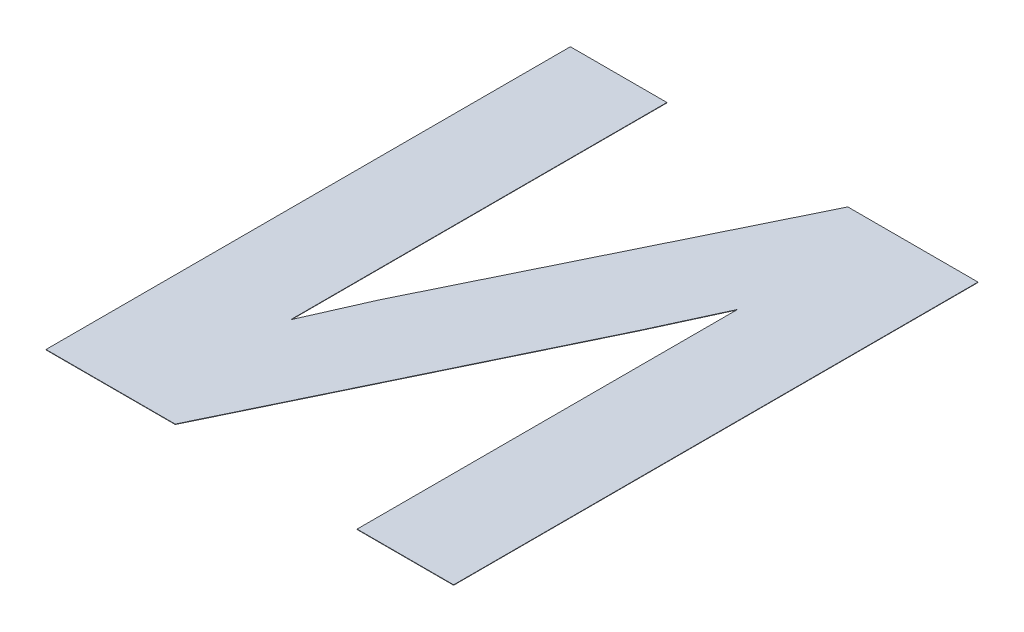
ISO-10303-21;
HEADER;
FILE_DESCRIPTION(('STEP AP214'),'2;1');
FILE_NAME('part.step','',(''),(''),'','','');
FILE_SCHEMA(('AUTOMOTIVE_DESIGN { 1 0 10303 214 1 1 1 1 }'));
ENDSEC;
DATA;
#1=APPLICATION_CONTEXT('core data for automotive mechanical design processes');
#2=APPLICATION_PROTOCOL_DEFINITION('international standard','automotive_design',2000,#1);
#3=PRODUCT_CONTEXT('',#1,'mechanical');
#4=PRODUCT('Part','Part','',(#3));
#5=PRODUCT_RELATED_PRODUCT_CATEGORY('part','',(#4));
#6=PRODUCT_DEFINITION_FORMATION('','',#4);
#7=PRODUCT_DEFINITION_CONTEXT('part definition',#1,'design');
#8=PRODUCT_DEFINITION('design','',#6,#7);
#9=PRODUCT_DEFINITION_SHAPE('','',#8);
#10=(LENGTH_UNIT() NAMED_UNIT(*) SI_UNIT(.MILLI.,.METRE.));
#11=(NAMED_UNIT(*) PLANE_ANGLE_UNIT() SI_UNIT($,.RADIAN.));
#12=(NAMED_UNIT(*) SI_UNIT($,.STERADIAN.) SOLID_ANGLE_UNIT());
#13=UNCERTAINTY_MEASURE_WITH_UNIT(LENGTH_MEASURE(1.E-05),#10,'distance_accuracy_value','');
#14=(GEOMETRIC_REPRESENTATION_CONTEXT(3) GLOBAL_UNCERTAINTY_ASSIGNED_CONTEXT((#13)) GLOBAL_UNIT_ASSIGNED_CONTEXT((#10,
#11,#12)) REPRESENTATION_CONTEXT('',''));
#15=CARTESIAN_POINT('',(0.,0.,0.));
#16=DIRECTION('',(0.,0.,1.));
#17=DIRECTION('',(1.,0.,0.));
#18=AXIS2_PLACEMENT_3D('',#15,#16,#17);
#19=CARTESIAN_POINT('',(26.67,0.00149999999999997,0.));
#20=DIRECTION('',(0.,-1.,0.));
#21=DIRECTION('',(0.,0.,-1.));
#22=AXIS2_PLACEMENT_3D('',#19,#20,#21);
#23=PLANE('',#22);
#24=DIRECTION('',(-0.418143605528176,0.,0.908380936147329));
#25=VECTOR('',#24,1.);
#26=CARTESIAN_POINT('',(10.316846398117,0.00149999999999997,-83.4365985771358));
#27=LINE('',#26,#25);
#28=CARTESIAN_POINT('',(10.316846398117,0.00149999999999997,-83.4365985771358));
#29=VERTEX_POINT('',#28);
#30=CARTESIAN_POINT('',(10.1985058857615,0.00149999999999997,-83.1795140158119));
#31=VERTEX_POINT('',#30);
#32=EDGE_CURVE('E177',#29,#31,#27,.T.);
#33=ORIENTED_EDGE('',*,*,#32,.T.);
#34=DIRECTION('',(-0.43416533781751,0.,0.900833202894857));
#35=VECTOR('',#34,1.);
#36=CARTESIAN_POINT('',(10.1985058857615,0.00149999999999997,-83.1795140158118));
#37=LINE('',#36,#35);
#38=CARTESIAN_POINT('',(9.62312615327458,0.00149999999999997,-81.9856804179882));
#39=VERTEX_POINT('',#38);
#40=EDGE_CURVE('E171',#31,#39,#37,.T.);
#41=ORIENTED_EDGE('',*,*,#40,.T.);
#42=DIRECTION('',(1.,0.,0.));
#43=VECTOR('',#42,1.);
#44=CARTESIAN_POINT('',(26.67,0.00149999999999997,-81.9856804179882));
#45=LINE('',#44,#43);
#46=CARTESIAN_POINT('',(9.13026739108914,0.00149999999999997,-81.9856804179882));
#47=VERTEX_POINT('',#46);
#48=EDGE_CURVE('E175',#39,#47,#45,.F.);
#49=ORIENTED_EDGE('',*,*,#48,.T.);
#50=DIRECTION('',(0.,0.,-1.));
#51=VECTOR('',#50,1.);
#52=CARTESIAN_POINT('',(9.13026739108914,0.00149999999999997,-83.9856804179882));
#53=LINE('',#52,#51);
#54=CARTESIAN_POINT('',(9.13026739108914,0.00149999999999997,-83.9856804179882));
#55=VERTEX_POINT('',#54);
#56=EDGE_CURVE('E111',#47,#55,#53,.T.);
#57=ORIENTED_EDGE('',*,*,#56,.T.);
#58=DIRECTION('',(1.,0.,0.));
#59=VECTOR('',#58,1.);
#60=CARTESIAN_POINT('',(9.49843787397283,0.00149999999999997,-83.9856804179882));
#61=LINE('',#60,#59);
#62=CARTESIAN_POINT('',(9.49843787397283,0.00149999999999997,-83.9856804179882));
#63=VERTEX_POINT('',#62);
#64=EDGE_CURVE('E107',#55,#63,#61,.T.);
#65=ORIENTED_EDGE('',*,*,#64,.T.);
#66=DIRECTION('',(0.,0.,1.));
#67=VECTOR('',#66,1.);
#68=CARTESIAN_POINT('',(9.49843787397283,0.00149999999999997,-83.4334246936626));
#69=LINE('',#68,#67);
#70=CARTESIAN_POINT('',(9.49843787397283,0.00149999999999997,-82.5501782642816));
#71=VERTEX_POINT('',#70);
#72=EDGE_CURVE('E165',#63,#71,#69,.T.);
#73=ORIENTED_EDGE('',*,*,#72,.T.);
#74=DIRECTION('',(0.40350948746594,0.,-0.914975460613548));
#75=VECTOR('',#74,1.);
#76=CARTESIAN_POINT('',(9.6018157928121,0.00149999999999997,-82.7845922293689));
#77=LINE('',#76,#75);
#78=CARTESIAN_POINT('',(9.60181579281193,0.00149999999999997,-82.7845922293685));
#79=VERTEX_POINT('',#78);
#80=EDGE_CURVE('E161',#71,#79,#77,.T.);
#81=ORIENTED_EDGE('',*,*,#80,.T.);
#82=DIRECTION('',(0.438918095726589,0.,-0.898527075409386));
#83=VECTOR('',#82,1.);
#84=CARTESIAN_POINT('',(10.1885308234174,0.00149999999999997,-83.9856804179882));
#85=LINE('',#84,#83);
#86=CARTESIAN_POINT('',(10.1885308234174,0.00149999999999997,-83.9856804179882));
#87=VERTEX_POINT('',#86);
#88=EDGE_CURVE('E156',#79,#87,#85,.T.);
#89=ORIENTED_EDGE('',*,*,#88,.T.);
#90=DIRECTION('',(1.,0.,0.));
#91=VECTOR('',#90,1.);
#92=CARTESIAN_POINT('',(10.6850168810007,0.00149999999999997,-83.9856804179882));
#93=LINE('',#92,#91);
#94=CARTESIAN_POINT('',(10.6850168810007,0.00149999999999997,-83.9856804179882));
#95=VERTEX_POINT('',#94);
#96=EDGE_CURVE('E150',#87,#95,#93,.T.);
#97=ORIENTED_EDGE('',*,*,#96,.T.);
#98=DIRECTION('',(0.,0.,1.));
#99=VECTOR('',#98,1.);
#100=CARTESIAN_POINT('',(10.6850168810007,0.00149999999999997,-81.9856804179882));
#101=LINE('',#100,#99);
#102=CARTESIAN_POINT('',(10.6850168810007,0.00149999999999997,-81.9856804179882));
#103=VERTEX_POINT('',#102);
#104=EDGE_CURVE('E142',#95,#103,#101,.T.);
#105=ORIENTED_EDGE('',*,*,#104,.T.);
#106=DIRECTION('',(1.,0.,0.));
#107=VECTOR('',#106,1.);
#108=CARTESIAN_POINT('',(26.67,0.00149999999999997,-81.9856804179882));
#109=LINE('',#108,#107);
#110=CARTESIAN_POINT('',(10.316846398117,0.00149999999999997,-81.9856804179882));
#111=VERTEX_POINT('',#110);
#112=EDGE_CURVE('E172',#103,#111,#109,.F.);
#113=ORIENTED_EDGE('',*,*,#112,.T.);
#114=DIRECTION('',(0.,0.,-1.));
#115=VECTOR('',#114,1.);
#116=CARTESIAN_POINT('',(10.316846398117,0.00149999999999997,0.));
#117=LINE('',#116,#115);
#118=EDGE_CURVE('E174',#111,#29,#117,.T.);
#119=ORIENTED_EDGE('',*,*,#118,.T.);
#120=EDGE_LOOP('',(#33,#41,#49,#57,#65,#73,#81,#89,#97,#105,#113,#119));
#121=FACE_BOUND('',#120,.T.);
#122=ADVANCED_FACE('F16',(#121),#23,.T.);
#123=CARTESIAN_POINT('',(9.13026739108914,0.00300000000000009,-83.9856804179882));
#124=DIRECTION('',(1.,0.,0.));
#125=DIRECTION('',(0.,0.,-1.));
#126=AXIS2_PLACEMENT_3D('',#123,#124,#125);
#127=PLANE('',#126);
#128=DIRECTION('',(0.,1.,0.));
#129=VECTOR('',#128,1.);
#130=CARTESIAN_POINT('',(9.13026739108914,0.00300000000000009,-81.9856804179882));
#131=LINE('',#130,#129);
#132=CARTESIAN_POINT('',(9.13026739108914,0.00300000000000009,-81.9856804179882));
#133=VERTEX_POINT('',#132);
#134=EDGE_CURVE('E124',#47,#133,#131,.T.);
#135=ORIENTED_EDGE('',*,*,#134,.T.);
#136=DIRECTION('',(0.,0.,-1.));
#137=VECTOR('',#136,1.);
#138=CARTESIAN_POINT('',(9.13026739108914,0.00300000000000009,0.));
#139=LINE('',#138,#137);
#140=CARTESIAN_POINT('',(9.13026739108914,0.00300000000000009,-83.9856804179882));
#141=VERTEX_POINT('',#140);
#142=EDGE_CURVE('E116',#133,#141,#139,.T.);
#143=ORIENTED_EDGE('',*,*,#142,.T.);
#144=DIRECTION('',(0.,1.,0.));
#145=VECTOR('',#144,1.);
#146=CARTESIAN_POINT('',(9.13026739108914,0.00300000000000009,-83.9856804179882));
#147=LINE('',#146,#145);
#148=EDGE_CURVE('E19',#141,#55,#147,.F.);
#149=ORIENTED_EDGE('',*,*,#148,.T.);
#150=ORIENTED_EDGE('',*,*,#56,.F.);
#151=EDGE_LOOP('',(#135,#143,#149,#150));
#152=FACE_BOUND('',#151,.T.);
#153=ADVANCED_FACE('F122',(#152),#127,.F.);
#154=CARTESIAN_POINT('',(9.49843787397283,0.00300000000000009,-83.9856804179882));
#155=DIRECTION('',(0.,0.,1.));
#156=DIRECTION('',(1.,0.,0.));
#157=AXIS2_PLACEMENT_3D('',#154,#155,#156);
#158=PLANE('',#157);
#159=ORIENTED_EDGE('',*,*,#148,.F.);
#160=DIRECTION('',(1.,0.,0.));
#161=VECTOR('',#160,1.);
#162=CARTESIAN_POINT('',(26.67,0.00300000000000009,-83.9856804179882));
#163=LINE('',#162,#161);
#164=CARTESIAN_POINT('',(9.49843787397283,0.00300000000000009,-83.9856804179882));
#165=VERTEX_POINT('',#164);
#166=EDGE_CURVE('E106',#141,#165,#163,.T.);
#167=ORIENTED_EDGE('',*,*,#166,.T.);
#168=DIRECTION('',(0.,1.,0.));
#169=VECTOR('',#168,1.);
#170=CARTESIAN_POINT('',(9.49843787397283,0.00300000000000009,-83.9856804179882));
#171=LINE('',#170,#169);
#172=EDGE_CURVE('E166',#165,#63,#171,.F.);
#173=ORIENTED_EDGE('',*,*,#172,.T.);
#174=ORIENTED_EDGE('',*,*,#64,.F.);
#175=EDGE_LOOP('',(#159,#167,#173,#174));
#176=FACE_BOUND('',#175,.T.);
#177=ADVANCED_FACE('F104',(#176),#158,.F.);
#178=CARTESIAN_POINT('',(9.49843787397283,0.00300000000000009,-83.4334246936626));
#179=DIRECTION('',(-1.,0.,0.));
#180=DIRECTION('',(0.,0.,1.));
#181=AXIS2_PLACEMENT_3D('',#178,#179,#180);
#182=PLANE('',#181);
#183=ORIENTED_EDGE('',*,*,#172,.F.);
#184=DIRECTION('',(0.,0.,-1.));
#185=VECTOR('',#184,1.);
#186=CARTESIAN_POINT('',(9.49843787397283,0.00300000000000009,0.));
#187=LINE('',#186,#185);
#188=CARTESIAN_POINT('',(9.49843787397283,0.00300000000000009,-82.5501782642816));
#189=VERTEX_POINT('',#188);
#190=EDGE_CURVE('E120',#165,#189,#187,.F.);
#191=ORIENTED_EDGE('',*,*,#190,.T.);
#192=DIRECTION('',(0.,1.,0.));
#193=VECTOR('',#192,1.);
#194=CARTESIAN_POINT('',(9.49843787397283,0.00300000000000009,-82.5501782642816));
#195=LINE('',#194,#193);
#196=EDGE_CURVE('E163',#189,#71,#195,.F.);
#197=ORIENTED_EDGE('',*,*,#196,.T.);
#198=ORIENTED_EDGE('',*,*,#72,.F.);
#199=EDGE_LOOP('',(#183,#191,#197,#198));
#200=FACE_BOUND('',#199,.T.);
#201=ADVANCED_FACE('F202',(#200),#182,.F.);
#202=CARTESIAN_POINT('',(9.6018157928121,0.00300000000000009,-82.7845922293689));
#203=DIRECTION('',(0.914975460613548,0.,0.40350948746594));
#204=DIRECTION('',(0.40350948746594,0.,-0.914975460613548));
#205=AXIS2_PLACEMENT_3D('',#202,#203,#204);
#206=PLANE('',#205);
#207=ORIENTED_EDGE('',*,*,#196,.F.);
#208=DIRECTION('',(0.40350948746592,0.,-0.914975460613557));
#209=VECTOR('',#208,1.);
#210=CARTESIAN_POINT('',(9.49843787397283,0.00300000000000009,-82.5501782642816));
#211=LINE('',#210,#209);
#212=CARTESIAN_POINT('',(9.60181579281209,0.00300000000000009,-82.7845922293689));
#213=VERTEX_POINT('',#212);
#214=EDGE_CURVE('E155',#189,#213,#211,.T.);
#215=ORIENTED_EDGE('',*,*,#214,.T.);
#216=DIRECTION('',(0.,1.,0.));
#217=VECTOR('',#216,1.);
#218=CARTESIAN_POINT('',(9.6018157928121,0.00300000000000009,-82.7845922293689));
#219=LINE('',#218,#217);
#220=EDGE_CURVE('E158',#213,#79,#219,.F.);
#221=ORIENTED_EDGE('',*,*,#220,.T.);
#222=ORIENTED_EDGE('',*,*,#80,.F.);
#223=EDGE_LOOP('',(#207,#215,#221,#222));
#224=FACE_BOUND('',#223,.T.);
#225=ADVANCED_FACE('F207',(#224),#206,.F.);
#226=CARTESIAN_POINT('',(10.1885308234174,0.00300000000000009,-83.9856804179882));
#227=DIRECTION('',(0.898527075409386,0.,0.438918095726589));
#228=DIRECTION('',(0.438918095726589,0.,-0.898527075409386));
#229=AXIS2_PLACEMENT_3D('',#226,#227,#228);
#230=PLANE('',#229);
#231=ORIENTED_EDGE('',*,*,#220,.F.);
#232=DIRECTION('',(0.438918095726607,0.,-0.898527075409377));
#233=VECTOR('',#232,1.);
#234=CARTESIAN_POINT('',(9.6018157928121,0.00300000000000009,-82.7845922293689));
#235=LINE('',#234,#233);
#236=CARTESIAN_POINT('',(10.1885308234174,0.00300000000000009,-83.9856804179882));
#237=VERTEX_POINT('',#236);
#238=EDGE_CURVE('E149',#213,#237,#235,.T.);
#239=ORIENTED_EDGE('',*,*,#238,.T.);
#240=DIRECTION('',(0.,1.,0.));
#241=VECTOR('',#240,1.);
#242=CARTESIAN_POINT('',(10.1885308234174,0.00300000000000009,-83.9856804179882));
#243=LINE('',#242,#241);
#244=EDGE_CURVE('E152',#237,#87,#243,.F.);
#245=ORIENTED_EDGE('',*,*,#244,.T.);
#246=ORIENTED_EDGE('',*,*,#88,.F.);
#247=EDGE_LOOP('',(#231,#239,#245,#246));
#248=FACE_BOUND('',#247,.T.);
#249=ADVANCED_FACE('F210',(#248),#230,.F.);
#250=CARTESIAN_POINT('',(10.6850168810007,0.00300000000000009,-83.9856804179882));
#251=DIRECTION('',(0.,0.,1.));
#252=DIRECTION('',(1.,0.,0.));
#253=AXIS2_PLACEMENT_3D('',#250,#251,#252);
#254=PLANE('',#253);
#255=ORIENTED_EDGE('',*,*,#244,.F.);
#256=DIRECTION('',(1.,0.,0.));
#257=VECTOR('',#256,1.);
#258=CARTESIAN_POINT('',(26.67,0.00300000000000009,-83.9856804179882));
#259=LINE('',#258,#257);
#260=CARTESIAN_POINT('',(10.6850168810007,0.00300000000000009,-83.9856804179882));
#261=VERTEX_POINT('',#260);
#262=EDGE_CURVE('E141',#237,#261,#259,.T.);
#263=ORIENTED_EDGE('',*,*,#262,.T.);
#264=DIRECTION('',(0.,1.,0.));
#265=VECTOR('',#264,1.);
#266=CARTESIAN_POINT('',(10.6850168810007,0.00300000000000009,-83.9856804179882));
#267=LINE('',#266,#265);
#268=EDGE_CURVE('E146',#261,#95,#267,.F.);
#269=ORIENTED_EDGE('',*,*,#268,.T.);
#270=ORIENTED_EDGE('',*,*,#96,.F.);
#271=EDGE_LOOP('',(#255,#263,#269,#270));
#272=FACE_BOUND('',#271,.T.);
#273=ADVANCED_FACE('F215',(#272),#254,.F.);
#274=CARTESIAN_POINT('',(10.6850168810007,0.00300000000000009,-81.9856804179882));
#275=DIRECTION('',(-1.,0.,0.));
#276=DIRECTION('',(0.,0.,1.));
#277=AXIS2_PLACEMENT_3D('',#274,#275,#276);
#278=PLANE('',#277);
#279=ORIENTED_EDGE('',*,*,#268,.F.);
#280=DIRECTION('',(0.,0.,-1.));
#281=VECTOR('',#280,1.);
#282=CARTESIAN_POINT('',(10.6850168810007,0.00300000000000009,0.));
#283=LINE('',#282,#281);
#284=CARTESIAN_POINT('',(10.6850168810007,0.00300000000000009,-81.9856804179882));
#285=VERTEX_POINT('',#284);
#286=EDGE_CURVE('E138',#261,#285,#283,.F.);
#287=ORIENTED_EDGE('',*,*,#286,.T.);
#288=DIRECTION('',(0.,1.,0.));
#289=VECTOR('',#288,1.);
#290=CARTESIAN_POINT('',(10.6850168810007,0.00300000000000009,-81.9856804179882));
#291=LINE('',#290,#289);
#292=EDGE_CURVE('E145',#285,#103,#291,.F.);
#293=ORIENTED_EDGE('',*,*,#292,.T.);
#294=ORIENTED_EDGE('',*,*,#104,.F.);
#295=EDGE_LOOP('',(#279,#287,#293,#294));
#296=FACE_BOUND('',#295,.T.);
#297=ADVANCED_FACE('F219',(#296),#278,.F.);
#298=CARTESIAN_POINT('',(10.316846398117,0.00300000000000009,-81.9856804179882));
#299=DIRECTION('',(0.,0.,-1.));
#300=DIRECTION('',(-1.,0.,0.));
#301=AXIS2_PLACEMENT_3D('',#298,#299,#300);
#302=PLANE('',#301);
#303=ORIENTED_EDGE('',*,*,#292,.F.);
#304=DIRECTION('',(1.,0.,0.));
#305=VECTOR('',#304,1.);
#306=CARTESIAN_POINT('',(26.67,0.00300000000000009,-81.9856804179882));
#307=LINE('',#306,#305);
#308=CARTESIAN_POINT('',(10.316846398117,0.00300000000000009,-81.9856804179882));
#309=VERTEX_POINT('',#308);
#310=EDGE_CURVE('E135',#285,#309,#307,.F.);
#311=ORIENTED_EDGE('',*,*,#310,.T.);
#312=DIRECTION('',(0.,1.,0.));
#313=VECTOR('',#312,1.);
#314=CARTESIAN_POINT('',(10.316846398117,0.00300000000000009,-81.9856804179882));
#315=LINE('',#314,#313);
#316=EDGE_CURVE('E188',#309,#111,#315,.F.);
#317=ORIENTED_EDGE('',*,*,#316,.T.);
#318=ORIENTED_EDGE('',*,*,#112,.F.);
#319=EDGE_LOOP('',(#303,#311,#317,#318));
#320=FACE_BOUND('',#319,.T.);
#321=ADVANCED_FACE('F221',(#320),#302,.F.);
#322=CARTESIAN_POINT('',(10.316846398117,0.00300000000000009,-82.6068547548733));
#323=DIRECTION('',(1.,0.,0.));
#324=DIRECTION('',(0.,0.,-1.));
#325=AXIS2_PLACEMENT_3D('',#322,#323,#324);
#326=PLANE('',#325);
#327=ORIENTED_EDGE('',*,*,#316,.F.);
#328=DIRECTION('',(0.,0.,-1.));
#329=VECTOR('',#328,1.);
#330=CARTESIAN_POINT('',(10.316846398117,0.00300000000000009,0.));
#331=LINE('',#330,#329);
#332=CARTESIAN_POINT('',(10.316846398117,0.00300000000000009,-83.4365985771358));
#333=VERTEX_POINT('',#332);
#334=EDGE_CURVE('E132',#309,#333,#331,.T.);
#335=ORIENTED_EDGE('',*,*,#334,.T.);
#336=DIRECTION('',(0.,1.,0.));
#337=VECTOR('',#336,1.);
#338=CARTESIAN_POINT('',(10.316846398117,0.00300000000000009,-83.4365985771358));
#339=LINE('',#338,#337);
#340=EDGE_CURVE('E185',#333,#29,#339,.F.);
#341=ORIENTED_EDGE('',*,*,#340,.T.);
#342=ORIENTED_EDGE('',*,*,#118,.F.);
#343=EDGE_LOOP('',(#327,#335,#341,#342));
#344=FACE_BOUND('',#343,.T.);
#345=ADVANCED_FACE('F225',(#344),#326,.F.);
#346=CARTESIAN_POINT('',(10.1985058857615,0.00300000000000009,-83.1795140158118));
#347=DIRECTION('',(-0.908380936147357,0.,-0.418143605528114));
#348=DIRECTION('',(-0.418143605528114,0.,0.908380936147357));
#349=AXIS2_PLACEMENT_3D('',#346,#347,#348);
#350=PLANE('',#349);
#351=ORIENTED_EDGE('',*,*,#340,.F.);
#352=DIRECTION('',(-0.418143605528176,0.,0.908380936147329));
#353=VECTOR('',#352,1.);
#354=CARTESIAN_POINT('',(10.316846398117,0.00300000000000009,-83.4365985771358));
#355=LINE('',#354,#353);
#356=CARTESIAN_POINT('',(10.1985058857615,0.00300000000000009,-83.1795140158119));
#357=VERTEX_POINT('',#356);
#358=EDGE_CURVE('E129',#333,#357,#355,.T.);
#359=ORIENTED_EDGE('',*,*,#358,.T.);
#360=DIRECTION('',(0.,1.,0.));
#361=VECTOR('',#360,1.);
#362=CARTESIAN_POINT('',(10.1985058857615,0.00300000000000009,-83.1795140158118));
#363=LINE('',#362,#361);
#364=EDGE_CURVE('E182',#357,#31,#363,.F.);
#365=ORIENTED_EDGE('',*,*,#364,.T.);
#366=ORIENTED_EDGE('',*,*,#32,.F.);
#367=EDGE_LOOP('',(#351,#359,#365,#366));
#368=FACE_BOUND('',#367,.T.);
#369=ADVANCED_FACE('F230',(#368),#350,.F.);
#370=CARTESIAN_POINT('',(9.62312615327458,0.00300000000000009,-81.9856804179882));
#371=DIRECTION('',(-0.900833202894847,0.,-0.434165337817532));
#372=DIRECTION('',(-0.434165337817532,0.,0.900833202894847));
#373=AXIS2_PLACEMENT_3D('',#370,#371,#372);
#374=PLANE('',#373);
#375=ORIENTED_EDGE('',*,*,#364,.F.);
#376=DIRECTION('',(-0.43416533781751,0.,0.900833202894857));
#377=VECTOR('',#376,1.);
#378=CARTESIAN_POINT('',(10.1985058857615,0.00300000000000009,-83.1795140158118));
#379=LINE('',#378,#377);
#380=CARTESIAN_POINT('',(9.62312615327458,0.00300000000000009,-81.9856804179882));
#381=VERTEX_POINT('',#380);
#382=EDGE_CURVE('E25',#357,#381,#379,.T.);
#383=ORIENTED_EDGE('',*,*,#382,.T.);
#384=DIRECTION('',(0.,1.,0.));
#385=VECTOR('',#384,1.);
#386=CARTESIAN_POINT('',(9.62312615327458,0.00300000000000009,-81.9856804179882));
#387=LINE('',#386,#385);
#388=EDGE_CURVE('E33',#381,#39,#387,.F.);
#389=ORIENTED_EDGE('',*,*,#388,.T.);
#390=ORIENTED_EDGE('',*,*,#40,.F.);
#391=EDGE_LOOP('',(#375,#383,#389,#390));
#392=FACE_BOUND('',#391,.T.);
#393=ADVANCED_FACE('F233',(#392),#374,.F.);
#394=CARTESIAN_POINT('',(9.13026739108914,0.00300000000000009,-81.9856804179882));
#395=DIRECTION('',(0.,0.,-1.));
#396=DIRECTION('',(-1.,0.,0.));
#397=AXIS2_PLACEMENT_3D('',#394,#395,#396);
#398=PLANE('',#397);
#399=ORIENTED_EDGE('',*,*,#388,.F.);
#400=DIRECTION('',(1.,0.,0.));
#401=VECTOR('',#400,1.);
#402=CARTESIAN_POINT('',(26.67,0.00300000000000009,-81.9856804179882));
#403=LINE('',#402,#401);
#404=EDGE_CURVE('E11',#381,#133,#403,.F.);
#405=ORIENTED_EDGE('',*,*,#404,.T.);
#406=ORIENTED_EDGE('',*,*,#134,.F.);
#407=ORIENTED_EDGE('',*,*,#48,.F.);
#408=EDGE_LOOP('',(#399,#405,#406,#407));
#409=FACE_BOUND('',#408,.T.);
#410=ADVANCED_FACE('F234',(#409),#398,.F.);
#411=CARTESIAN_POINT('',(26.67,0.00300000000000009,0.));
#412=DIRECTION('',(0.,-1.,0.));
#413=DIRECTION('',(0.,0.,-1.));
#414=AXIS2_PLACEMENT_3D('',#411,#412,#413);
#415=PLANE('',#414);
#416=ORIENTED_EDGE('',*,*,#382,.F.);
#417=ORIENTED_EDGE('',*,*,#358,.F.);
#418=ORIENTED_EDGE('',*,*,#334,.F.);
#419=ORIENTED_EDGE('',*,*,#310,.F.);
#420=ORIENTED_EDGE('',*,*,#286,.F.);
#421=ORIENTED_EDGE('',*,*,#262,.F.);
#422=ORIENTED_EDGE('',*,*,#238,.F.);
#423=ORIENTED_EDGE('',*,*,#214,.F.);
#424=ORIENTED_EDGE('',*,*,#190,.F.);
#425=ORIENTED_EDGE('',*,*,#166,.F.);
#426=ORIENTED_EDGE('',*,*,#142,.F.);
#427=ORIENTED_EDGE('',*,*,#404,.F.);
#428=EDGE_LOOP('',(#416,#417,#418,#419,#420,#421,#422,#423,#424,#425,#426,#427));
#429=FACE_BOUND('',#428,.T.);
#430=ADVANCED_FACE('F115',(#429),#415,.F.);
#431=CLOSED_SHELL('',(#122,#153,#177,#201,#225,#249,#273,#297,#321,#345,#369,#393,#410,#430));
#432=MANIFOLD_SOLID_BREP('B1',#431);
#433=ADVANCED_BREP_SHAPE_REPRESENTATION('',(#18,#432),#14);
#434=SHAPE_DEFINITION_REPRESENTATION(#9,#433);
ENDSEC;
END-ISO-10303-21;
